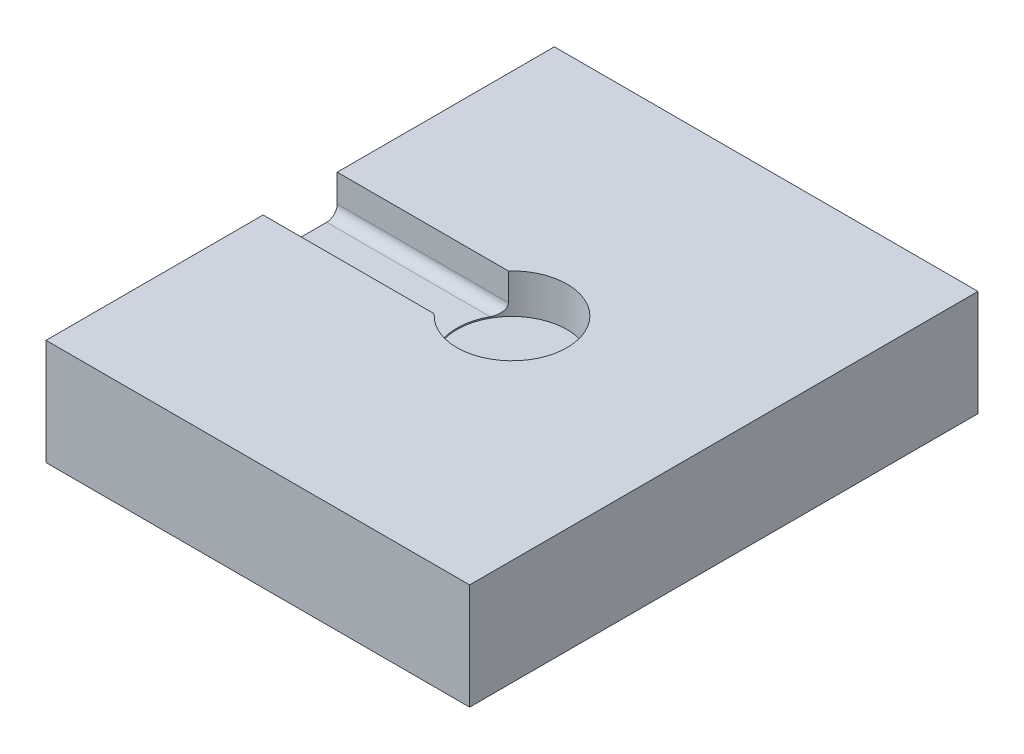
ISO-10303-21;
HEADER;
FILE_DESCRIPTION(('STEP AP214'),'2;1');
FILE_NAME('part.step','',(''),(''),'','','');
FILE_SCHEMA(('AUTOMOTIVE_DESIGN { 1 0 10303 214 1 1 1 1 }'));
ENDSEC;
DATA;
#1=APPLICATION_CONTEXT('core data for automotive mechanical design processes');
#2=APPLICATION_PROTOCOL_DEFINITION('international standard','automotive_design',2000,#1);
#3=PRODUCT_CONTEXT('',#1,'mechanical');
#4=PRODUCT('Part','Part','',(#3));
#5=PRODUCT_RELATED_PRODUCT_CATEGORY('part','',(#4));
#6=PRODUCT_DEFINITION_FORMATION('','',#4);
#7=PRODUCT_DEFINITION_CONTEXT('part definition',#1,'design');
#8=PRODUCT_DEFINITION('design','',#6,#7);
#9=PRODUCT_DEFINITION_SHAPE('','',#8);
#10=(LENGTH_UNIT() NAMED_UNIT(*) SI_UNIT(.MILLI.,.METRE.));
#11=(NAMED_UNIT(*) PLANE_ANGLE_UNIT() SI_UNIT($,.RADIAN.));
#12=(NAMED_UNIT(*) SI_UNIT($,.STERADIAN.) SOLID_ANGLE_UNIT());
#13=UNCERTAINTY_MEASURE_WITH_UNIT(LENGTH_MEASURE(1.E-05),#10,'distance_accuracy_value','');
#14=(GEOMETRIC_REPRESENTATION_CONTEXT(3) GLOBAL_UNCERTAINTY_ASSIGNED_CONTEXT((#13)) GLOBAL_UNIT_ASSIGNED_CONTEXT((#10,
#11,#12)) REPRESENTATION_CONTEXT('',''));
#15=CARTESIAN_POINT('',(0.,0.,0.));
#16=DIRECTION('',(0.,0.,1.));
#17=DIRECTION('',(1.,0.,0.));
#18=AXIS2_PLACEMENT_3D('',#15,#16,#17);
#19=CARTESIAN_POINT('',(-100.,50.,-120.));
#20=DIRECTION('',(1.,0.,0.));
#21=DIRECTION('',(0.,0.,-1.));
#22=AXIS2_PLACEMENT_3D('',#19,#20,#21);
#23=PLANE('',#22);
#24=DIRECTION('',(0.,0.,-1.));
#25=VECTOR('',#24,1.);
#26=CARTESIAN_POINT('',(-100.,32.,17.5));
#27=LINE('',#26,#25);
#28=CARTESIAN_POINT('',(-100.,32.,12.5));
#29=VERTEX_POINT('',#28);
#30=CARTESIAN_POINT('',(-100.,32.,-12.5));
#31=VERTEX_POINT('',#30);
#32=EDGE_CURVE('E119',#29,#31,#27,.T.);
#33=ORIENTED_EDGE('',*,*,#32,.T.);
#34=CARTESIAN_POINT('',(-100.,37.,-12.5));
#35=DIRECTION('',(1.,0.,0.));
#36=DIRECTION('',(0.,0.,-1.));
#37=AXIS2_PLACEMENT_3D('',#34,#35,#36);
#38=CIRCLE('',#37,5.);
#39=CARTESIAN_POINT('',(-100.,37.,-17.5));
#40=VERTEX_POINT('',#39);
#41=EDGE_CURVE('E48',#31,#40,#38,.T.);
#42=ORIENTED_EDGE('',*,*,#41,.T.);
#43=DIRECTION('',(0.,1.,0.));
#44=VECTOR('',#43,1.);
#45=CARTESIAN_POINT('',(-100.,32.,-17.5));
#46=LINE('',#45,#44);
#47=CARTESIAN_POINT('',(-100.,50.,-17.5));
#48=VERTEX_POINT('',#47);
#49=EDGE_CURVE('E113',#40,#48,#46,.T.);
#50=ORIENTED_EDGE('',*,*,#49,.T.);
#51=DIRECTION('',(0.,0.,1.));
#52=VECTOR('',#51,1.);
#53=CARTESIAN_POINT('',(-100.,50.,-120.));
#54=LINE('',#53,#52);
#55=CARTESIAN_POINT('',(-100.,50.,-120.));
#56=VERTEX_POINT('',#55);
#57=EDGE_CURVE('E117',#56,#48,#54,.T.);
#58=ORIENTED_EDGE('',*,*,#57,.F.);
#59=DIRECTION('',(0.,-1.,0.));
#60=VECTOR('',#59,1.);
#61=CARTESIAN_POINT('',(-100.,50.,-120.));
#62=LINE('',#61,#60);
#63=CARTESIAN_POINT('',(-100.,0.,-120.));
#64=VERTEX_POINT('',#63);
#65=EDGE_CURVE('E145',#56,#64,#62,.T.);
#66=ORIENTED_EDGE('',*,*,#65,.T.);
#67=DIRECTION('',(0.,0.,1.));
#68=VECTOR('',#67,1.);
#69=CARTESIAN_POINT('',(-100.,0.,-120.));
#70=LINE('',#69,#68);
#71=CARTESIAN_POINT('',(-100.,0.,120.));
#72=VERTEX_POINT('',#71);
#73=EDGE_CURVE('E146',#64,#72,#70,.T.);
#74=ORIENTED_EDGE('',*,*,#73,.T.);
#75=DIRECTION('',(0.,-1.,0.));
#76=VECTOR('',#75,1.);
#77=CARTESIAN_POINT('',(-100.,50.,120.));
#78=LINE('',#77,#76);
#79=CARTESIAN_POINT('',(-100.,50.,120.));
#80=VERTEX_POINT('',#79);
#81=EDGE_CURVE('E162',#80,#72,#78,.T.);
#82=ORIENTED_EDGE('',*,*,#81,.F.);
#83=CARTESIAN_POINT('',(-100.,50.,17.5));
#84=VERTEX_POINT('',#83);
#85=EDGE_CURVE('E135',#84,#80,#54,.T.);
#86=ORIENTED_EDGE('',*,*,#85,.F.);
#87=DIRECTION('',(0.,-1.,0.));
#88=VECTOR('',#87,1.);
#89=CARTESIAN_POINT('',(-100.,32.,17.5));
#90=LINE('',#89,#88);
#91=CARTESIAN_POINT('',(-100.,37.,17.5));
#92=VERTEX_POINT('',#91);
#93=EDGE_CURVE('E231',#84,#92,#90,.T.);
#94=ORIENTED_EDGE('',*,*,#93,.T.);
#95=CARTESIAN_POINT('',(-100.,37.,12.5));
#96=DIRECTION('',(1.,0.,0.));
#97=DIRECTION('',(0.,0.,-1.));
#98=AXIS2_PLACEMENT_3D('',#95,#96,#97);
#99=CIRCLE('',#98,5.);
#100=EDGE_CURVE('E174',#92,#29,#99,.T.);
#101=ORIENTED_EDGE('',*,*,#100,.T.);
#102=EDGE_LOOP('',(#33,#42,#50,#58,#66,#74,#82,#86,#94,#101));
#103=FACE_BOUND('',#102,.T.);
#104=ADVANCED_FACE('F34',(#103),#23,.F.);
#105=CARTESIAN_POINT('',(0.,50.,0.));
#106=DIRECTION('',(0.,-1.,0.));
#107=DIRECTION('',(0.,0.,-1.));
#108=AXIS2_PLACEMENT_3D('',#105,#106,#107);
#109=PLANE('',#108);
#110=DIRECTION('',(-1.,0.,0.));
#111=VECTOR('',#110,1.);
#112=CARTESIAN_POINT('',(100.001,50.,-17.5));
#113=LINE('',#112,#111);
#114=CARTESIAN_POINT('',(-19.2288845230294,50.,-17.5));
#115=VERTEX_POINT('',#114);
#116=EDGE_CURVE('E122',#115,#48,#113,.T.);
#117=ORIENTED_EDGE('',*,*,#116,.F.);
#118=CARTESIAN_POINT('',(0.,50.,0.));
#119=DIRECTION('',(0.,1.,0.));
#120=DIRECTION('',(0.,0.,1.));
#121=AXIS2_PLACEMENT_3D('',#118,#119,#120);
#122=CIRCLE('',#121,26.);
#123=CARTESIAN_POINT('',(-19.2288845230294,50.,17.5));
#124=VERTEX_POINT('',#123);
#125=EDGE_CURVE('E128',#124,#115,#122,.T.);
#126=ORIENTED_EDGE('',*,*,#125,.F.);
#127=DIRECTION('',(-1.,0.,0.));
#128=VECTOR('',#127,1.);
#129=CARTESIAN_POINT('',(100.001,50.,17.5));
#130=LINE('',#129,#128);
#131=EDGE_CURVE('E118',#124,#84,#130,.T.);
#132=ORIENTED_EDGE('',*,*,#131,.T.);
#133=ORIENTED_EDGE('',*,*,#85,.T.);
#134=DIRECTION('',(1.,0.,0.));
#135=VECTOR('',#134,1.);
#136=CARTESIAN_POINT('',(100.,50.,120.));
#137=LINE('',#136,#135);
#138=CARTESIAN_POINT('',(100.,50.,120.));
#139=VERTEX_POINT('',#138);
#140=EDGE_CURVE('E134',#80,#139,#137,.T.);
#141=ORIENTED_EDGE('',*,*,#140,.T.);
#142=DIRECTION('',(0.,0.,-1.));
#143=VECTOR('',#142,1.);
#144=CARTESIAN_POINT('',(100.,50.,-120.));
#145=LINE('',#144,#143);
#146=CARTESIAN_POINT('',(100.,50.,-120.));
#147=VERTEX_POINT('',#146);
#148=EDGE_CURVE('E137',#139,#147,#145,.T.);
#149=ORIENTED_EDGE('',*,*,#148,.T.);
#150=DIRECTION('',(-1.,0.,0.));
#151=VECTOR('',#150,1.);
#152=CARTESIAN_POINT('',(100.,50.,-120.));
#153=LINE('',#152,#151);
#154=EDGE_CURVE('E132',#147,#56,#153,.T.);
#155=ORIENTED_EDGE('',*,*,#154,.T.);
#156=ORIENTED_EDGE('',*,*,#57,.T.);
#157=EDGE_LOOP('',(#117,#126,#132,#133,#141,#149,#155,#156));
#158=FACE_BOUND('',#157,.T.);
#159=ADVANCED_FACE('F130',(#158),#109,.F.);
#160=CARTESIAN_POINT('',(0.,31.4,0.));
#161=DIRECTION('',(0.,1.,0.));
#162=DIRECTION('',(0.,0.,1.));
#163=AXIS2_PLACEMENT_3D('',#160,#161,#162);
#164=CYLINDRICAL_SURFACE('',#163,26.);
#165=CARTESIAN_POINT('',(0.,31.4,0.));
#166=DIRECTION('',(0.,1.,0.));
#167=DIRECTION('',(0.,0.,1.));
#168=AXIS2_PLACEMENT_3D('',#165,#166,#167);
#169=CIRCLE('',#168,26.);
#170=CARTESIAN_POINT('',(0.,31.4,26.));
#171=VERTEX_POINT('',#170);
#172=EDGE_CURVE('E150',#171,#171,#169,.T.);
#173=ORIENTED_EDGE('',*,*,#172,.F.);
#174=EDGE_LOOP('',(#173));
#175=FACE_BOUND('',#174,.T.);
#176=DIRECTION('',(0.,1.,0.));
#177=VECTOR('',#176,1.);
#178=CARTESIAN_POINT('',(-19.2288845230294,31.4,-17.5));
#179=LINE('',#178,#177);
#180=CARTESIAN_POINT('',(-19.2288845230294,37.,-17.5));
#181=VERTEX_POINT('',#180);
#182=EDGE_CURVE('E124',#115,#181,#179,.F.);
#183=ORIENTED_EDGE('',*,*,#182,.T.);
#184=CARTESIAN_POINT('',(-19.2288845230294,37.,-17.5));
#185=CARTESIAN_POINT('',(-19.2288485310497,36.8825407457726,-17.5000286993519));
#186=CARTESIAN_POINT('',(-19.2326502315988,36.7651068244702,-17.4958620543834));
#187=CARTESIAN_POINT('',(-19.2476530716669,36.5313900426684,-17.4793614261446));
#188=CARTESIAN_POINT('',(-19.258847732469,36.4151062647355,-17.4670345939169));
#189=CARTESIAN_POINT('',(-19.2882303598149,36.1856048558515,-17.4345810007729));
#190=CARTESIAN_POINT('',(-19.3063553277608,36.0723691648745,-17.414524492301));
#191=CARTESIAN_POINT('',(-19.3491183343673,35.8487359540884,-17.3669987060607));
#192=CARTESIAN_POINT('',(-19.3737574758344,35.7383389183204,-17.3395281731307));
#193=CARTESIAN_POINT('',(-19.4564305892624,35.4132178072027,-17.2468593741907));
#194=CARTESIAN_POINT('',(-19.5233520546633,35.2035922910592,-17.1712611222971));
#195=CARTESIAN_POINT('',(-19.6759718792974,34.8016235082977,-16.9961649301262));
#196=CARTESIAN_POINT('',(-19.7617191303292,34.6093271154743,-16.8966046929825));
#197=CARTESIAN_POINT('',(-19.9840247643172,34.1713202389375,-16.6336647403054));
#198=CARTESIAN_POINT('',(-20.127233926942,33.9347504724771,-16.4606461942773));
#199=CARTESIAN_POINT('',(-20.4302299849598,33.5007497224732,-16.0830493765961));
#200=CARTESIAN_POINT('',(-20.5900391258972,33.3033723185059,-15.8784285715095));
#201=CARTESIAN_POINT('',(-20.9210623006571,32.9454596351577,-15.4397527428821));
#202=CARTESIAN_POINT('',(-21.0924230469966,32.785600560593,-15.2052601730819));
#203=CARTESIAN_POINT('',(-21.4377068794505,32.5082741381506,-14.7144331534341));
#204=CARTESIAN_POINT('',(-21.6116275080315,32.390768582088,-14.4581186491106));
#205=CARTESIAN_POINT('',(-21.8714212940594,32.247261483638,-14.0593956424187));
#206=CARTESIAN_POINT('',(-21.9582895144781,32.2047494500211,-13.9233631348372));
#207=CARTESIAN_POINT('',(-22.1308366745789,32.1313490072851,-13.6474357634971));
#208=CARTESIAN_POINT('',(-22.2165157144129,32.1004596135245,-13.5075412279983));
#209=CARTESIAN_POINT('',(-22.3862084067046,32.0506643622836,-13.2244059688542));
#210=CARTESIAN_POINT('',(-22.470219924873,32.0317730097164,-13.0811614112171));
#211=CARTESIAN_POINT('',(-22.6359690848817,32.0064394967747,-12.7922170525403));
#212=CARTESIAN_POINT('',(-22.7177059578369,32.0000014967427,-12.6465164473904));
#213=CARTESIAN_POINT('',(-22.798026230356,32.,-12.5));
#214=B_SPLINE_CURVE_WITH_KNOTS('',3,(#184,#185,#186,#187,#188,#189,#190,#191,#192,#193,#194,
#195,#196,#197,#198,#199,#200,#201,#202,#203,#204,#205,#206,#207,#208,#209,#210,#211,#212,#213),
.UNSPECIFIED.,.F.,.F.,(4,2,2,2,2,2,2,2,2,2,2,2,2,2,4),(0.,0.352201274434205,0.704094311070856,
1.05286178921076,1.40168834922482,2.09640857621377,2.79295484117021,3.76629969899677,
4.7409661838447,5.73204179514092,6.72222108089569,7.22257331268552,7.7228831463113,
8.22379667896013,8.72487752496254),.UNSPECIFIED.);
#215=CARTESIAN_POINT('',(-22.798026230356,32.,-12.5));
#216=VERTEX_POINT('',#215);
#217=EDGE_CURVE('E11',#181,#216,#214,.T.);
#218=ORIENTED_EDGE('',*,*,#217,.T.);
#219=CARTESIAN_POINT('',(0.,32.,0.));
#220=DIRECTION('',(0.,1.,0.));
#221=DIRECTION('',(0.,0.,1.));
#222=AXIS2_PLACEMENT_3D('',#219,#220,#221);
#223=CIRCLE('',#222,26.);
#224=CARTESIAN_POINT('',(-22.798026230356,32.,12.5));
#225=VERTEX_POINT('',#224);
#226=EDGE_CURVE('E222',#216,#225,#223,.T.);
#227=ORIENTED_EDGE('',*,*,#226,.T.);
#228=CARTESIAN_POINT('',(-22.798026230356,32.,12.5));
#229=CARTESIAN_POINT('',(-22.6953312492464,32.0000048554119,12.6873665176498));
#230=CARTESIAN_POINT('',(-22.5903083101995,32.0105292263947,12.873368916149));
#231=CARTESIAN_POINT('',(-22.376786746533,32.0517558596582,13.2410018888888));
#232=CARTESIAN_POINT('',(-22.2682895885374,32.0824497115887,13.4226342526539));
#233=CARTESIAN_POINT('',(-22.0488096655506,32.1631933654598,13.7802096059397));
#234=CARTESIAN_POINT('',(-21.9378246690851,32.2132612576793,13.9561471110785));
#235=CARTESIAN_POINT('',(-21.714685852971,32.3320087524465,14.3008577748259));
#236=CARTESIAN_POINT('',(-21.6025320315754,32.4006883828174,14.4696309227239));
#237=CARTESIAN_POINT('',(-21.391989621566,32.5466225342394,14.7788166036426));
#238=CARTESIAN_POINT('',(-21.2935805507205,32.6218281857459,14.920186898074));
#239=CARTESIAN_POINT('',(-21.0978927292336,32.7858309594001,15.1956393923679));
#240=CARTESIAN_POINT('',(-21.0006139206542,32.8746273815379,15.3297219671119));
#241=CARTESIAN_POINT('',(-20.8083834967043,33.0655337504326,15.5896527838175));
#242=CARTESIAN_POINT('',(-20.7134301384614,33.1676333399295,15.7155073184668));
#243=CARTESIAN_POINT('',(-20.5271281408655,33.3850056428173,15.9580834598813));
#244=CARTESIAN_POINT('',(-20.4357786388498,33.5002751776342,16.0748072589462));
#245=CARTESIAN_POINT('',(-20.2102324367695,33.8096879246732,16.3583173535881));
#246=CARTESIAN_POINT('',(-20.0794694383509,34.0128644815575,16.5181910675474));
#247=CARTESIAN_POINT('',(-19.8371346944656,34.4493452204205,16.8084456422644));
#248=CARTESIAN_POINT('',(-19.7255354969822,34.6826054540409,16.9388687766416));
#249=CARTESIAN_POINT('',(-19.5496152736067,35.1278782003294,17.1413798652927));
#250=CARTESIAN_POINT('',(-19.4803071111406,35.3349250778334,17.2199076812682));
#251=CARTESIAN_POINT('',(-19.3936460897895,35.6560169872937,17.3172850839213));
#252=CARTESIAN_POINT('',(-19.3676528606427,35.7647340042935,17.3463307059134));
#253=CARTESIAN_POINT('',(-19.3219525875313,35.9851132214291,17.397221649412));
#254=CARTESIAN_POINT('',(-19.30224331691,36.0967743631257,17.4190695214593));
#255=CARTESIAN_POINT('',(-19.2671509965383,36.3392274067246,17.4578833169278));
#256=CARTESIAN_POINT('',(-19.252857414391,36.470380643292,17.4736286369986));
#257=CARTESIAN_POINT('',(-19.2385041534177,36.6682869388116,17.4894254221546));
#258=CARTESIAN_POINT('',(-19.2349008777684,36.7345089879986,17.4933875172928));
#259=CARTESIAN_POINT('',(-19.2300900072147,36.8671493458059,17.4986755287996));
#260=CARTESIAN_POINT('',(-19.228882572327,36.9335676672385,17.5000012690875));
#261=CARTESIAN_POINT('',(-19.2288845230294,37.,17.5));
#262=B_SPLINE_CURVE_WITH_KNOTS('',3,(#228,#229,#230,#231,#232,#233,#234,#235,#236,#237,#238,
#239,#240,#241,#242,#243,#244,#245,#246,#247,#248,#249,#250,#251,#252,#253,#254,#255,#256,#257,
#258,#259,#260,#261),.UNSPECIFIED.,.F.,.F.,(4,2,2,2,2,2,2,2,2,2,2,2,2,2,2,2,4),(0.,
0.64060848998122,1.28095002585401,1.9218909214161,2.5628327751475,3.12607399141942,
3.68928620699495,4.25206252159985,4.81470329559142,5.68050012661295,6.5450461714854,
7.2380727909645,7.58417806567504,7.9301605648609,8.32794157676107,8.52717357610036,
8.72641888158254),.UNSPECIFIED.);
#263=CARTESIAN_POINT('',(-19.2288845230294,37.,17.5));
#264=VERTEX_POINT('',#263);
#265=EDGE_CURVE('E176',#225,#264,#262,.T.);
#266=ORIENTED_EDGE('',*,*,#265,.T.);
#267=DIRECTION('',(0.,1.,0.));
#268=VECTOR('',#267,1.);
#269=CARTESIAN_POINT('',(-19.2288845230294,31.4,17.5));
#270=LINE('',#269,#268);
#271=EDGE_CURVE('E233',#264,#124,#270,.T.);
#272=ORIENTED_EDGE('',*,*,#271,.T.);
#273=ORIENTED_EDGE('',*,*,#125,.T.);
#274=EDGE_LOOP('',(#183,#218,#227,#266,#272,#273));
#275=FACE_BOUND('',#274,.T.);
#276=ADVANCED_FACE('F181',(#175,#275),#164,.F.);
#277=CARTESIAN_POINT('',(100.,50.,120.));
#278=DIRECTION('',(0.,0.,-1.));
#279=DIRECTION('',(-1.,0.,0.));
#280=AXIS2_PLACEMENT_3D('',#277,#278,#279);
#281=PLANE('',#280);
#282=DIRECTION('',(1.,0.,0.));
#283=VECTOR('',#282,1.);
#284=CARTESIAN_POINT('',(100.,0.,120.));
#285=LINE('',#284,#283);
#286=CARTESIAN_POINT('',(100.,0.,120.));
#287=VERTEX_POINT('',#286);
#288=EDGE_CURVE('E149',#72,#287,#285,.T.);
#289=ORIENTED_EDGE('',*,*,#288,.T.);
#290=DIRECTION('',(0.,-1.,0.));
#291=VECTOR('',#290,1.);
#292=CARTESIAN_POINT('',(100.,50.,120.));
#293=LINE('',#292,#291);
#294=EDGE_CURVE('E159',#139,#287,#293,.T.);
#295=ORIENTED_EDGE('',*,*,#294,.F.);
#296=ORIENTED_EDGE('',*,*,#140,.F.);
#297=ORIENTED_EDGE('',*,*,#81,.T.);
#298=EDGE_LOOP('',(#289,#295,#296,#297));
#299=FACE_BOUND('',#298,.T.);
#300=ADVANCED_FACE('F193',(#299),#281,.F.);
#301=CARTESIAN_POINT('',(100.,50.,-120.));
#302=DIRECTION('',(-1.,0.,0.));
#303=DIRECTION('',(0.,0.,1.));
#304=AXIS2_PLACEMENT_3D('',#301,#302,#303);
#305=PLANE('',#304);
#306=DIRECTION('',(0.,0.,-1.));
#307=VECTOR('',#306,1.);
#308=CARTESIAN_POINT('',(100.,0.,-120.));
#309=LINE('',#308,#307);
#310=CARTESIAN_POINT('',(100.,0.,-120.));
#311=VERTEX_POINT('',#310);
#312=EDGE_CURVE('E152',#287,#311,#309,.T.);
#313=ORIENTED_EDGE('',*,*,#312,.T.);
#314=DIRECTION('',(0.,-1.,0.));
#315=VECTOR('',#314,1.);
#316=CARTESIAN_POINT('',(100.,50.,-120.));
#317=LINE('',#316,#315);
#318=EDGE_CURVE('E156',#147,#311,#317,.T.);
#319=ORIENTED_EDGE('',*,*,#318,.F.);
#320=ORIENTED_EDGE('',*,*,#148,.F.);
#321=ORIENTED_EDGE('',*,*,#294,.T.);
#322=EDGE_LOOP('',(#313,#319,#320,#321));
#323=FACE_BOUND('',#322,.T.);
#324=ADVANCED_FACE('F196',(#323),#305,.F.);
#325=CARTESIAN_POINT('',(100.,50.,-120.));
#326=DIRECTION('',(0.,0.,1.));
#327=DIRECTION('',(1.,0.,0.));
#328=AXIS2_PLACEMENT_3D('',#325,#326,#327);
#329=PLANE('',#328);
#330=DIRECTION('',(-1.,0.,0.));
#331=VECTOR('',#330,1.);
#332=CARTESIAN_POINT('',(100.,0.,-120.));
#333=LINE('',#332,#331);
#334=EDGE_CURVE('E139',#311,#64,#333,.T.);
#335=ORIENTED_EDGE('',*,*,#334,.T.);
#336=ORIENTED_EDGE('',*,*,#65,.F.);
#337=ORIENTED_EDGE('',*,*,#154,.F.);
#338=ORIENTED_EDGE('',*,*,#318,.T.);
#339=EDGE_LOOP('',(#335,#336,#337,#338));
#340=FACE_BOUND('',#339,.T.);
#341=ADVANCED_FACE('F200',(#340),#329,.F.);
#342=CARTESIAN_POINT('',(0.,0.,0.));
#343=DIRECTION('',(0.,-1.,0.));
#344=DIRECTION('',(0.,0.,-1.));
#345=AXIS2_PLACEMENT_3D('',#342,#343,#344);
#346=PLANE('',#345);
#347=ORIENTED_EDGE('',*,*,#73,.F.);
#348=ORIENTED_EDGE('',*,*,#334,.F.);
#349=ORIENTED_EDGE('',*,*,#312,.F.);
#350=ORIENTED_EDGE('',*,*,#288,.F.);
#351=EDGE_LOOP('',(#347,#348,#349,#350));
#352=FACE_BOUND('',#351,.T.);
#353=ADVANCED_FACE('F204',(#352),#346,.T.);
#354=CARTESIAN_POINT('',(0.,31.4,0.));
#355=DIRECTION('',(0.,1.,0.));
#356=DIRECTION('',(0.,0.,1.));
#357=AXIS2_PLACEMENT_3D('',#354,#355,#356);
#358=PLANE('',#357);
#359=ORIENTED_EDGE('',*,*,#172,.T.);
#360=EDGE_LOOP('',(#359));
#361=FACE_BOUND('',#360,.T.);
#362=ADVANCED_FACE('F207',(#361),#358,.T.);
#363=CARTESIAN_POINT('',(100.001,32.,-17.5));
#364=DIRECTION('',(0.,0.,1.));
#365=DIRECTION('',(1.,0.,0.));
#366=AXIS2_PLACEMENT_3D('',#363,#364,#365);
#367=PLANE('',#366);
#368=ORIENTED_EDGE('',*,*,#49,.F.);
#369=DIRECTION('',(-1.,0.,0.));
#370=VECTOR('',#369,1.);
#371=CARTESIAN_POINT('',(-19.2288845230294,37.,-17.5));
#372=LINE('',#371,#370);
#373=EDGE_CURVE('E55',#40,#181,#372,.F.);
#374=ORIENTED_EDGE('',*,*,#373,.T.);
#375=ORIENTED_EDGE('',*,*,#182,.F.);
#376=ORIENTED_EDGE('',*,*,#116,.T.);
#377=EDGE_LOOP('',(#368,#374,#375,#376));
#378=FACE_BOUND('',#377,.T.);
#379=ADVANCED_FACE('F123',(#378),#367,.T.);
#380=CARTESIAN_POINT('',(100.001,32.,17.5));
#381=DIRECTION('',(0.,1.,0.));
#382=DIRECTION('',(0.,0.,1.));
#383=AXIS2_PLACEMENT_3D('',#380,#381,#382);
#384=PLANE('',#383);
#385=ORIENTED_EDGE('',*,*,#32,.F.);
#386=DIRECTION('',(-1.,0.,0.));
#387=VECTOR('',#386,1.);
#388=CARTESIAN_POINT('',(-19.2288845230294,32.,12.5));
#389=LINE('',#388,#387);
#390=EDGE_CURVE('E171',#29,#225,#389,.F.);
#391=ORIENTED_EDGE('',*,*,#390,.T.);
#392=ORIENTED_EDGE('',*,*,#226,.F.);
#393=DIRECTION('',(-1.,0.,0.));
#394=VECTOR('',#393,1.);
#395=CARTESIAN_POINT('',(-100.,32.,-12.5));
#396=LINE('',#395,#394);
#397=EDGE_CURVE('E168',#216,#31,#396,.T.);
#398=ORIENTED_EDGE('',*,*,#397,.T.);
#399=EDGE_LOOP('',(#385,#391,#392,#398));
#400=FACE_BOUND('',#399,.T.);
#401=ADVANCED_FACE('F228',(#400),#384,.T.);
#402=CARTESIAN_POINT('',(100.001,32.,17.5));
#403=DIRECTION('',(0.,0.,-1.));
#404=DIRECTION('',(-1.,0.,0.));
#405=AXIS2_PLACEMENT_3D('',#402,#403,#404);
#406=PLANE('',#405);
#407=ORIENTED_EDGE('',*,*,#271,.F.);
#408=DIRECTION('',(-1.,0.,0.));
#409=VECTOR('',#408,1.);
#410=CARTESIAN_POINT('',(-100.,37.,17.5));
#411=LINE('',#410,#409);
#412=EDGE_CURVE('E165',#264,#92,#411,.T.);
#413=ORIENTED_EDGE('',*,*,#412,.T.);
#414=ORIENTED_EDGE('',*,*,#93,.F.);
#415=ORIENTED_EDGE('',*,*,#131,.F.);
#416=EDGE_LOOP('',(#407,#413,#414,#415));
#417=FACE_BOUND('',#416,.T.);
#418=ADVANCED_FACE('F189',(#417),#406,.T.);
#419=CARTESIAN_POINT('',(100.001,37.,12.5));
#420=DIRECTION('',(1.,0.,0.));
#421=DIRECTION('',(0.,0.,-1.));
#422=AXIS2_PLACEMENT_3D('',#419,#420,#421);
#423=CYLINDRICAL_SURFACE('',#422,5.);
#424=ORIENTED_EDGE('',*,*,#265,.F.);
#425=ORIENTED_EDGE('',*,*,#390,.F.);
#426=ORIENTED_EDGE('',*,*,#100,.F.);
#427=ORIENTED_EDGE('',*,*,#412,.F.);
#428=EDGE_LOOP('',(#424,#425,#426,#427));
#429=FACE_BOUND('',#428,.T.);
#430=ADVANCED_FACE('F185',(#429),#423,.F.);
#431=CARTESIAN_POINT('',(100.001,37.,-12.5));
#432=DIRECTION('',(1.,0.,0.));
#433=DIRECTION('',(0.,0.,-1.));
#434=AXIS2_PLACEMENT_3D('',#431,#432,#433);
#435=CYLINDRICAL_SURFACE('',#434,5.);
#436=ORIENTED_EDGE('',*,*,#217,.F.);
#437=ORIENTED_EDGE('',*,*,#373,.F.);
#438=ORIENTED_EDGE('',*,*,#41,.F.);
#439=ORIENTED_EDGE('',*,*,#397,.F.);
#440=EDGE_LOOP('',(#436,#437,#438,#439));
#441=FACE_BOUND('',#440,.T.);
#442=ADVANCED_FACE('F36',(#441),#435,.F.);
#443=CLOSED_SHELL('',(#104,#159,#276,#300,#324,#341,#353,#362,#379,#401,#418,#430,#442));
#444=MANIFOLD_SOLID_BREP('B2',#443);
#445=ADVANCED_BREP_SHAPE_REPRESENTATION('',(#18,#444),#14);
#446=SHAPE_DEFINITION_REPRESENTATION(#9,#445);
ENDSEC;
END-ISO-10303-21;
